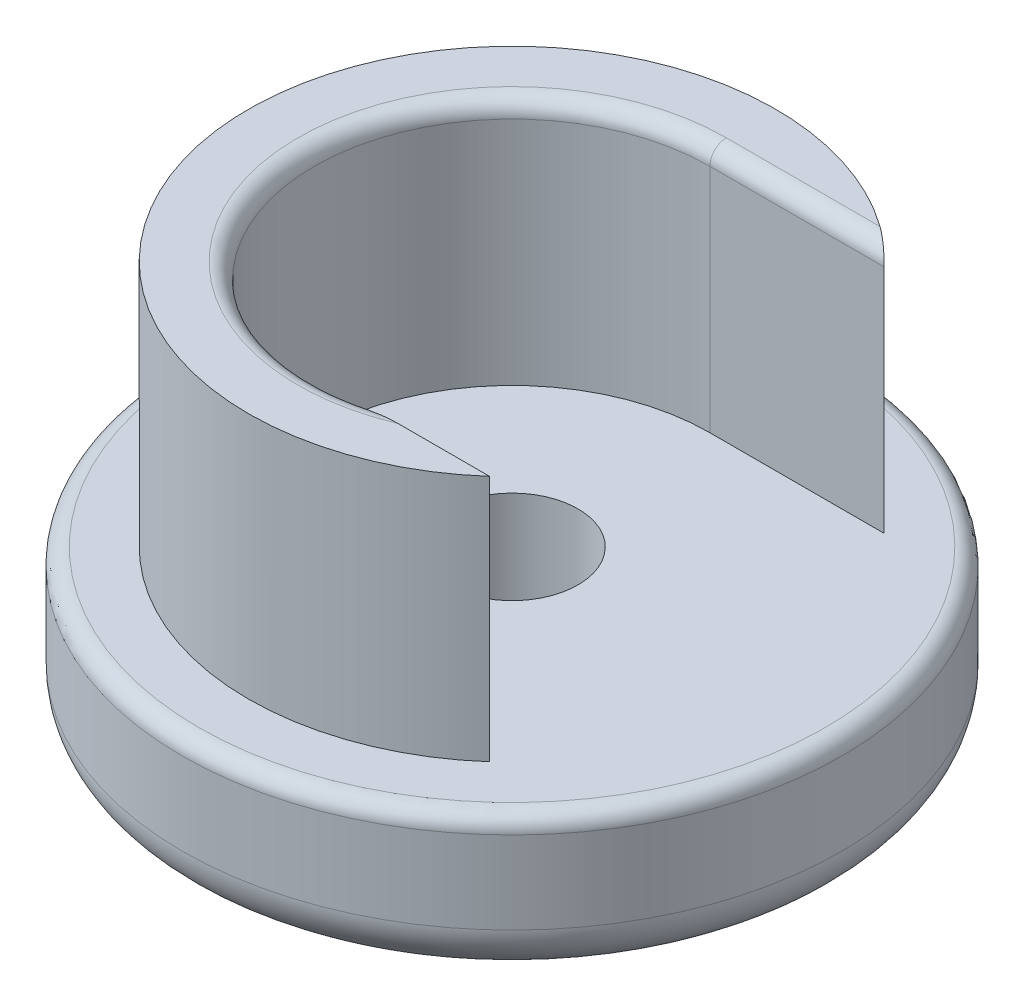
ISO-10303-21;
HEADER;
FILE_DESCRIPTION(('STEP AP214'),'2;1');
FILE_NAME('part.step','',(''),(''),'','','');
FILE_SCHEMA(('AUTOMOTIVE_DESIGN { 1 0 10303 214 1 1 1 1 }'));
ENDSEC;
DATA;
#1=APPLICATION_CONTEXT('core data for automotive mechanical design processes');
#2=APPLICATION_PROTOCOL_DEFINITION('international standard','automotive_design',2000,#1);
#3=PRODUCT_CONTEXT('',#1,'mechanical');
#4=PRODUCT('Part','Part','',(#3));
#5=PRODUCT_RELATED_PRODUCT_CATEGORY('part','',(#4));
#6=PRODUCT_DEFINITION_FORMATION('','',#4);
#7=PRODUCT_DEFINITION_CONTEXT('part definition',#1,'design');
#8=PRODUCT_DEFINITION('design','',#6,#7);
#9=PRODUCT_DEFINITION_SHAPE('','',#8);
#10=(LENGTH_UNIT() NAMED_UNIT(*) SI_UNIT(.MILLI.,.METRE.));
#11=(NAMED_UNIT(*) PLANE_ANGLE_UNIT() SI_UNIT($,.RADIAN.));
#12=(NAMED_UNIT(*) SI_UNIT($,.STERADIAN.) SOLID_ANGLE_UNIT());
#13=UNCERTAINTY_MEASURE_WITH_UNIT(LENGTH_MEASURE(1.E-05),#10,'distance_accuracy_value','');
#14=(GEOMETRIC_REPRESENTATION_CONTEXT(3) GLOBAL_UNCERTAINTY_ASSIGNED_CONTEXT((#13)) GLOBAL_UNIT_ASSIGNED_CONTEXT((#10,
#11,#12)) REPRESENTATION_CONTEXT('',''));
#15=CARTESIAN_POINT('',(0.,0.,0.));
#16=DIRECTION('',(0.,0.,1.));
#17=DIRECTION('',(1.,0.,0.));
#18=AXIS2_PLACEMENT_3D('',#15,#16,#17);
#19=CARTESIAN_POINT('',(0.,9.,0.));
#20=DIRECTION('',(0.,1.,0.));
#21=DIRECTION('',(0.,0.,1.));
#22=AXIS2_PLACEMENT_3D('',#19,#20,#21);
#23=CYLINDRICAL_SURFACE('',#22,12.);
#24=DIRECTION('',(0.,1.,0.));
#25=VECTOR('',#24,1.);
#26=CARTESIAN_POINT('',(0.,9.,-12.));
#27=LINE('',#26,#25);
#28=CARTESIAN_POINT('',(0.,9.,-12.));
#29=VERTEX_POINT('',#28);
#30=CARTESIAN_POINT('',(0.,23.,-12.));
#31=VERTEX_POINT('',#30);
#32=EDGE_CURVE('E123',#29,#31,#27,.T.);
#33=ORIENTED_EDGE('',*,*,#32,.T.);
#34=CARTESIAN_POINT('',(0.,23.,0.));
#35=DIRECTION('',(0.,1.,0.));
#36=DIRECTION('',(0.,0.,1.));
#37=AXIS2_PLACEMENT_3D('',#34,#35,#36);
#38=CIRCLE('',#37,12.);
#39=CARTESIAN_POINT('',(0.749948450219691,23.,11.9765427950646));
#40=VERTEX_POINT('',#39);
#41=EDGE_CURVE('E55',#31,#40,#38,.T.);
#42=ORIENTED_EDGE('',*,*,#41,.T.);
#43=DIRECTION('',(0.,1.,0.));
#44=VECTOR('',#43,1.);
#45=CARTESIAN_POINT('',(0.749948450219691,9.,11.9765427950646));
#46=LINE('',#45,#44);
#47=CARTESIAN_POINT('',(0.749948450219691,9.,11.9765427950646));
#48=VERTEX_POINT('',#47);
#49=EDGE_CURVE('E118',#40,#48,#46,.F.);
#50=ORIENTED_EDGE('',*,*,#49,.T.);
#51=CARTESIAN_POINT('',(0.,9.,0.));
#52=DIRECTION('',(0.,1.,0.));
#53=DIRECTION('',(0.,0.,1.));
#54=AXIS2_PLACEMENT_3D('',#51,#52,#53);
#55=CIRCLE('',#54,12.);
#56=EDGE_CURVE('E111',#29,#48,#55,.T.);
#57=ORIENTED_EDGE('',*,*,#56,.F.);
#58=EDGE_LOOP('',(#33,#42,#50,#57));
#59=FACE_BOUND('',#58,.T.);
#60=ADVANCED_FACE('F39',(#59),#23,.F.);
#61=CARTESIAN_POINT('',(0.,9.,0.));
#62=DIRECTION('',(0.,-1.,0.));
#63=DIRECTION('',(0.,0.,-1.));
#64=AXIS2_PLACEMENT_3D('',#61,#62,#63);
#65=CYLINDRICAL_SURFACE('',#64,20.);
#66=CARTESIAN_POINT('',(0.,8.,0.));
#67=DIRECTION('',(0.,1.,0.));
#68=DIRECTION('',(0.,0.,1.));
#69=AXIS2_PLACEMENT_3D('',#66,#67,#68);
#70=CIRCLE('',#69,20.);
#71=CARTESIAN_POINT('',(0.,8.,20.));
#72=VERTEX_POINT('',#71);
#73=EDGE_CURVE('E11',#72,#72,#70,.F.);
#74=ORIENTED_EDGE('',*,*,#73,.T.);
#75=EDGE_LOOP('',(#74));
#76=FACE_BOUND('',#75,.T.);
#77=CARTESIAN_POINT('',(0.,3.,0.));
#78=DIRECTION('',(0.,1.,0.));
#79=DIRECTION('',(0.,0.,1.));
#80=AXIS2_PLACEMENT_3D('',#77,#78,#79);
#81=CIRCLE('',#80,20.);
#82=CARTESIAN_POINT('',(0.,3.,20.));
#83=VERTEX_POINT('',#82);
#84=EDGE_CURVE('E176',#83,#83,#81,.T.);
#85=ORIENTED_EDGE('',*,*,#84,.T.);
#86=EDGE_LOOP('',(#85));
#87=FACE_BOUND('',#86,.T.);
#88=ADVANCED_FACE('F163',(#76,#87),#65,.T.);
#89=CARTESIAN_POINT('',(0.,9.,0.));
#90=DIRECTION('',(0.,1.,0.));
#91=DIRECTION('',(0.,0.,1.));
#92=AXIS2_PLACEMENT_3D('',#89,#90,#91);
#93=PLANE('',#92);
#94=CARTESIAN_POINT('',(0.,9.,0.));
#95=DIRECTION('',(0.,1.,0.));
#96=DIRECTION('',(0.,0.,1.));
#97=AXIS2_PLACEMENT_3D('',#94,#95,#96);
#98=CIRCLE('',#97,19.);
#99=CARTESIAN_POINT('',(0.,9.,19.));
#100=VERTEX_POINT('',#99);
#101=EDGE_CURVE('E48',#100,#100,#98,.T.);
#102=ORIENTED_EDGE('',*,*,#101,.T.);
#103=EDGE_LOOP('',(#102));
#104=FACE_BOUND('',#103,.T.);
#105=CARTESIAN_POINT('',(0.,9.,0.));
#106=DIRECTION('',(0.,1.,0.));
#107=DIRECTION('',(0.,0.,1.));
#108=AXIS2_PLACEMENT_3D('',#105,#106,#107);
#109=CIRCLE('',#108,4.);
#110=CARTESIAN_POINT('',(0.,9.,4.));
#111=VERTEX_POINT('',#110);
#112=EDGE_CURVE('E235',#111,#111,#109,.T.);
#113=ORIENTED_EDGE('',*,*,#112,.F.);
#114=EDGE_LOOP('',(#113));
#115=FACE_BOUND('',#114,.T.);
#116=CARTESIAN_POINT('',(0.,9.,0.));
#117=DIRECTION('',(0.,1.,0.));
#118=DIRECTION('',(0.,0.,1.));
#119=AXIS2_PLACEMENT_3D('',#116,#117,#118);
#120=CIRCLE('',#119,16.);
#121=CARTESIAN_POINT('',(10.5830052442584,9.,-12.));
#122=VERTEX_POINT('',#121);
#123=CARTESIAN_POINT('',(10.6095439429783,9.,11.9765427950646));
#124=VERTEX_POINT('',#123);
#125=EDGE_CURVE('E110',#122,#124,#120,.T.);
#126=ORIENTED_EDGE('',*,*,#125,.F.);
#127=DIRECTION('',(-1.,0.,0.));
#128=VECTOR('',#127,1.);
#129=CARTESIAN_POINT('',(0.,9.,-12.));
#130=LINE('',#129,#128);
#131=EDGE_CURVE('E227',#122,#29,#130,.T.);
#132=ORIENTED_EDGE('',*,*,#131,.T.);
#133=ORIENTED_EDGE('',*,*,#56,.T.);
#134=DIRECTION('',(1.,0.,0.));
#135=VECTOR('',#134,1.);
#136=CARTESIAN_POINT('',(0.,9.,11.9765427950646));
#137=LINE('',#136,#135);
#138=EDGE_CURVE('E100',#48,#124,#137,.T.);
#139=ORIENTED_EDGE('',*,*,#138,.T.);
#140=EDGE_LOOP('',(#126,#132,#133,#139));
#141=FACE_BOUND('',#140,.T.);
#142=ADVANCED_FACE('F161',(#104,#115,#141),#93,.T.);
#143=CARTESIAN_POINT('',(0.,0.,0.));
#144=DIRECTION('',(0.,1.,0.));
#145=DIRECTION('',(0.,0.,1.));
#146=AXIS2_PLACEMENT_3D('',#143,#144,#145);
#147=PLANE('',#146);
#148=CARTESIAN_POINT('',(0.,0.,0.));
#149=DIRECTION('',(0.,1.,0.));
#150=DIRECTION('',(0.,0.,1.));
#151=AXIS2_PLACEMENT_3D('',#148,#149,#150);
#152=CIRCLE('',#151,17.);
#153=CARTESIAN_POINT('',(0.,0.,17.));
#154=VERTEX_POINT('',#153);
#155=EDGE_CURVE('E179',#154,#154,#152,.F.);
#156=ORIENTED_EDGE('',*,*,#155,.T.);
#157=EDGE_LOOP('',(#156));
#158=FACE_BOUND('',#157,.T.);
#159=CARTESIAN_POINT('',(0.,0.,0.));
#160=DIRECTION('',(0.,1.,0.));
#161=DIRECTION('',(0.,0.,1.));
#162=AXIS2_PLACEMENT_3D('',#159,#160,#161);
#163=CIRCLE('',#162,4.);
#164=CARTESIAN_POINT('',(0.,0.,4.));
#165=VERTEX_POINT('',#164);
#166=EDGE_CURVE('E231',#165,#165,#163,.T.);
#167=ORIENTED_EDGE('',*,*,#166,.T.);
#168=EDGE_LOOP('',(#167));
#169=FACE_BOUND('',#168,.T.);
#170=ADVANCED_FACE('F158',(#158,#169),#147,.F.);
#171=CARTESIAN_POINT('',(0.,24.,0.));
#172=DIRECTION('',(0.,-1.,0.));
#173=DIRECTION('',(0.,0.,-1.));
#174=AXIS2_PLACEMENT_3D('',#171,#172,#173);
#175=CYLINDRICAL_SURFACE('',#174,16.);
#176=CARTESIAN_POINT('',(0.,24.,0.));
#177=DIRECTION('',(0.,1.,0.));
#178=DIRECTION('',(0.,0.,1.));
#179=AXIS2_PLACEMENT_3D('',#176,#177,#178);
#180=CIRCLE('',#179,16.);
#181=CARTESIAN_POINT('',(9.32737905308881,24.,-13.));
#182=VERTEX_POINT('',#181);
#183=CARTESIAN_POINT('',(10.6095439429783,24.,11.9765427950646));
#184=VERTEX_POINT('',#183);
#185=EDGE_CURVE('E104',#182,#184,#180,.T.);
#186=ORIENTED_EDGE('',*,*,#185,.F.);
#187=CARTESIAN_POINT('',(9.32737905308881,24.,-13.));
#188=CARTESIAN_POINT('',(9.38733669960589,23.9999699236779,-12.9569877648365));
#189=CARTESIAN_POINT('',(9.44702896333437,23.9972209178862,-12.9135242128153));
#190=CARTESIAN_POINT('',(9.56569114898083,23.9857277500073,-12.8258711496793));
#191=CARTESIAN_POINT('',(9.62465675188453,23.976957333956,-12.7816792899183));
#192=CARTESIAN_POINT('',(9.74198014743399,23.9526809597153,-12.6924914834544));
#193=CARTESIAN_POINT('',(9.80031689759493,23.9370796516231,-12.6474931343324));
#194=CARTESIAN_POINT('',(9.91470628052456,23.8983466310327,-12.5580193809069));
#195=CARTESIAN_POINT('',(9.9707633580954,23.8752304493649,-12.5135430924278));
#196=CARTESIAN_POINT('',(10.0743631479326,23.8231389253245,-12.43025272751));
#197=CARTESIAN_POINT('',(10.1222010874204,23.7949631627753,-12.3913119007309));
#198=CARTESIAN_POINT('',(10.2141102835149,23.7308406547604,-12.3156595837218));
#199=CARTESIAN_POINT('',(10.258193013547,23.6949188580304,-12.2789414099318));
#200=CARTESIAN_POINT('',(10.3343339357437,23.6209610992055,-12.2148926981825));
#201=CARTESIAN_POINT('',(10.3671801231821,23.584228667156,-12.187008387329));
#202=CARTESIAN_POINT('',(10.4278169529509,23.5043007912501,-12.1351645545671));
#203=CARTESIAN_POINT('',(10.4556133722305,23.4611128369971,-12.1112005509805));
#204=CARTESIAN_POINT('',(10.4982096913637,23.3801206892692,-12.0742777351078));
#205=CARTESIAN_POINT('',(10.5145204783598,23.3436866857635,-12.0600664156176));
#206=CARTESIAN_POINT('',(10.5423931939421,23.2678100690204,-12.0357088719517));
#207=CARTESIAN_POINT('',(10.5539663186246,23.2283748132538,-12.0255530651535));
#208=CARTESIAN_POINT('',(10.5693991718057,23.1574562591511,-12.0119891523348));
#209=CARTESIAN_POINT('',(10.5744609850242,23.1264319504551,-12.0075314106389));
#210=CARTESIAN_POINT('',(10.5812829467142,23.0636196167996,-12.0015189364844));
#211=CARTESIAN_POINT('',(10.5830294262096,23.0318289749586,-11.9999762226784));
#212=CARTESIAN_POINT('',(10.5830052442584,23.,-12.));
#213=B_SPLINE_CURVE_WITH_KNOTS('',3,(#187,#188,#189,#190,#191,#192,#193,#194,#195,#196,#197,
#198,#199,#200,#201,#202,#203,#204,#205,#206,#207,#208,#209,#210,#211,#212),.UNSPECIFIED.,.F.,
.F.,(4,2,2,2,2,2,2,2,2,2,2,2,4),(0.,0.221390816364776,0.443753101156386,0.669323464806758,
0.894430579430143,1.09740414310825,1.29973347417375,1.46901710335517,1.63810583501812,
1.76474676296203,1.8910866595096,1.98603287848848,2.08136971348778),.UNSPECIFIED.);
#214=CARTESIAN_POINT('',(10.5830052442584,23.,-12.));
#215=VERTEX_POINT('',#214);
#216=EDGE_CURVE('E140',#182,#215,#213,.T.);
#217=ORIENTED_EDGE('',*,*,#216,.T.);
#218=DIRECTION('',(0.,-1.,0.));
#219=VECTOR('',#218,1.);
#220=CARTESIAN_POINT('',(10.5830052442584,24.,-12.));
#221=LINE('',#220,#219);
#222=EDGE_CURVE('E117',#215,#122,#221,.T.);
#223=ORIENTED_EDGE('',*,*,#222,.T.);
#224=ORIENTED_EDGE('',*,*,#125,.T.);
#225=DIRECTION('',(0.,-1.,0.));
#226=VECTOR('',#225,1.);
#227=CARTESIAN_POINT('',(10.6095439429783,24.,11.9765427950646));
#228=LINE('',#227,#226);
#229=EDGE_CURVE('E95',#124,#184,#228,.F.);
#230=ORIENTED_EDGE('',*,*,#229,.T.);
#231=EDGE_LOOP('',(#186,#217,#223,#224,#230));
#232=FACE_BOUND('',#231,.T.);
#233=ADVANCED_FACE('F114',(#232),#175,.T.);
#234=CARTESIAN_POINT('',(0.,24.,0.));
#235=DIRECTION('',(0.,1.,0.));
#236=DIRECTION('',(0.,0.,1.));
#237=AXIS2_PLACEMENT_3D('',#234,#235,#236);
#238=PLANE('',#237);
#239=CARTESIAN_POINT('',(0.,24.,0.));
#240=DIRECTION('',(0.,1.,0.));
#241=DIRECTION('',(0.,0.,1.));
#242=AXIS2_PLACEMENT_3D('',#239,#240,#241);
#243=CIRCLE('',#242,13.);
#244=CARTESIAN_POINT('',(5.05592945737843,24.,11.9765427950646));
#245=VERTEX_POINT('',#244);
#246=CARTESIAN_POINT('',(0.,24.,-13.));
#247=VERTEX_POINT('',#246);
#248=EDGE_CURVE('E63',#245,#247,#243,.F.);
#249=ORIENTED_EDGE('',*,*,#248,.T.);
#250=DIRECTION('',(-1.,0.,0.));
#251=VECTOR('',#250,1.);
#252=CARTESIAN_POINT('',(10.5830052442584,24.,-13.));
#253=LINE('',#252,#251);
#254=EDGE_CURVE('E106',#247,#182,#253,.F.);
#255=ORIENTED_EDGE('',*,*,#254,.T.);
#256=ORIENTED_EDGE('',*,*,#185,.T.);
#257=DIRECTION('',(1.,0.,0.));
#258=VECTOR('',#257,1.);
#259=CARTESIAN_POINT('',(0.,24.,11.9765427950646));
#260=LINE('',#259,#258);
#261=EDGE_CURVE('E90',#245,#184,#260,.T.);
#262=ORIENTED_EDGE('',*,*,#261,.F.);
#263=EDGE_LOOP('',(#249,#255,#256,#262));
#264=FACE_BOUND('',#263,.T.);
#265=ADVANCED_FACE('F105',(#264),#238,.T.);
#266=CARTESIAN_POINT('',(0.,9.,-12.));
#267=DIRECTION('',(0.,0.,-1.));
#268=DIRECTION('',(-1.,0.,0.));
#269=AXIS2_PLACEMENT_3D('',#266,#267,#268);
#270=PLANE('',#269);
#271=ORIENTED_EDGE('',*,*,#222,.F.);
#272=DIRECTION('',(-1.,0.,0.));
#273=VECTOR('',#272,1.);
#274=CARTESIAN_POINT('',(0.,23.,-12.));
#275=LINE('',#274,#273);
#276=EDGE_CURVE('E132',#215,#31,#275,.T.);
#277=ORIENTED_EDGE('',*,*,#276,.T.);
#278=ORIENTED_EDGE('',*,*,#32,.F.);
#279=ORIENTED_EDGE('',*,*,#131,.F.);
#280=EDGE_LOOP('',(#271,#277,#278,#279));
#281=FACE_BOUND('',#280,.T.);
#282=ADVANCED_FACE('F217',(#281),#270,.F.);
#283=CARTESIAN_POINT('',(0.,9.,11.9765427950646));
#284=DIRECTION('',(0.,0.,1.));
#285=DIRECTION('',(1.,0.,0.));
#286=AXIS2_PLACEMENT_3D('',#283,#284,#285);
#287=PLANE('',#286);
#288=ORIENTED_EDGE('',*,*,#49,.F.);
#289=CARTESIAN_POINT('',(0.749948450219691,23.,11.9765427950646));
#290=CARTESIAN_POINT('',(0.749935232469696,23.0039757207967,11.9765427950646));
#291=CARTESIAN_POINT('',(0.750327266910166,23.0079322704996,11.9765427950646));
#292=CARTESIAN_POINT('',(0.751793892167884,23.0156566089796,11.9765427950646));
#293=CARTESIAN_POINT('',(0.752857895365614,23.0194263647267,11.9765427950646));
#294=CARTESIAN_POINT('',(0.756010863660049,23.0280173697372,11.9765427950646));
#295=CARTESIAN_POINT('',(0.758326705800493,23.0327531775025,11.9765427950646));
#296=CARTESIAN_POINT('',(0.763668811319105,23.0418314973793,11.9765427950646));
#297=CARTESIAN_POINT('',(0.766699983942616,23.046170990593,11.9765427950646));
#298=CARTESIAN_POINT('',(0.777832226229041,23.0603661481454,11.9765427950646));
#299=CARTESIAN_POINT('',(0.787036159397925,23.0693347910738,11.9765427950646));
#300=CARTESIAN_POINT('',(0.806554064313658,23.0859512232397,11.9765427950646));
#301=CARTESIAN_POINT('',(0.816874409307471,23.0935907010513,11.9765427950646));
#302=CARTESIAN_POINT('',(0.848982795973364,23.1154610788035,11.9765427950646));
#303=CARTESIAN_POINT('',(0.87164839241315,23.1283901382313,11.9765427950646));
#304=CARTESIAN_POINT('',(0.917853022371373,23.1526063005538,11.9765427950646));
#305=CARTESIAN_POINT('',(0.941394530609221,23.1638882246322,11.9765427950646));
#306=CARTESIAN_POINT('',(0.988998280382711,23.1854488943696,11.9765427950646));
#307=CARTESIAN_POINT('',(1.0130615235952,23.1957254537725,11.9765427950646));
#308=CARTESIAN_POINT('',(1.06142555668921,23.215578180964,11.9765427950646));
#309=CARTESIAN_POINT('',(1.08572592399549,23.2251554023076,11.9765427950646));
#310=CARTESIAN_POINT('',(1.15838852180002,23.2529660652195,11.9765427950646));
#311=CARTESIAN_POINT('',(1.20701969207295,23.2704959656999,11.9765427950646));
#312=CARTESIAN_POINT('',(1.3046792165186,23.3044177142769,11.9765427950646));
#313=CARTESIAN_POINT('',(1.35370764214515,23.3208093523227,11.9765427950646));
#314=CARTESIAN_POINT('',(1.50127543593803,23.3688205200122,11.9765427950646));
#315=CARTESIAN_POINT('',(1.60020410314436,23.399242598267,11.9765427950646));
#316=CARTESIAN_POINT('',(1.79833073051,23.4578943757002,11.9765427950646));
#317=CARTESIAN_POINT('',(1.89752659839255,23.486131246689,11.9765427950646));
#318=CARTESIAN_POINT('',(2.09638386005526,23.5407888128811,11.9765427950646));
#319=CARTESIAN_POINT('',(2.19604510275871,23.5672100589249,11.9765427950646));
#320=CARTESIAN_POINT('',(2.52122118355102,23.6504052018259,11.9765427950646));
#321=CARTESIAN_POINT('',(2.74765321569406,23.7036401576265,11.9765427950646));
#322=CARTESIAN_POINT('',(3.2026852293018,23.7998591801766,11.9765427950646));
#323=CARTESIAN_POINT('',(3.43128477841245,23.8428452483311,11.9765427950646));
#324=CARTESIAN_POINT('',(3.77620353757162,23.8974732532332,11.9765427950646));
#325=CARTESIAN_POINT('',(3.89174136405927,23.9140635136442,11.9765427950646));
#326=CARTESIAN_POINT('',(4.12329220059164,23.9433959708142,11.9765427950646));
#327=CARTESIAN_POINT('',(4.23930513316165,23.9561387714831,11.9765427950646));
#328=CARTESIAN_POINT('',(4.47192159480133,23.9772025165152,11.9765427950646));
#329=CARTESIAN_POINT('',(4.58852575105408,23.9855167566126,11.9765427950646));
#330=CARTESIAN_POINT('',(4.82204908217143,23.9968985689777,11.9765427950646));
#331=CARTESIAN_POINT('',(4.93896839640681,23.9999632139505,11.9765427950646));
#332=CARTESIAN_POINT('',(5.05592945737842,24.,11.9765427950646));
#333=B_SPLINE_CURVE_WITH_KNOTS('',3,(#289,#290,#291,#292,#293,#294,#295,#296,#297,#298,#299,
#300,#301,#302,#303,#304,#305,#306,#307,#308,#309,#310,#311,#312,#313,#314,#315,#316,#317,#318,
#319,#320,#321,#322,#323,#324,#325,#326,#327,#328,#329,#330,#331,#332),.UNSPECIFIED.,.F.,.F.,(4,
2,2,2,2,2,2,2,2,2,2,2,2,2,2,2,2,2,2,2,2,4),(0.,0.0118770803321293,0.0235715395773735,
0.0392968985597627,0.055133489766552,0.093387661029101,0.131873055550755,0.209940614889276,
0.288248574238231,0.3667232029754,0.445077060110991,0.600129866904549,0.755211210964169,
1.06567111107627,1.37506458998385,1.68436378409099,2.38198301020709,3.0794658932953,
3.42958181432669,3.77964275140272,4.13023213984363,4.48101696143569),.UNSPECIFIED.);
#334=EDGE_CURVE('E98',#40,#245,#333,.T.);
#335=ORIENTED_EDGE('',*,*,#334,.T.);
#336=ORIENTED_EDGE('',*,*,#261,.T.);
#337=ORIENTED_EDGE('',*,*,#229,.F.);
#338=ORIENTED_EDGE('',*,*,#138,.F.);
#339=EDGE_LOOP('',(#288,#335,#336,#337,#338));
#340=FACE_BOUND('',#339,.T.);
#341=ADVANCED_FACE('F92',(#340),#287,.F.);
#342=CARTESIAN_POINT('',(0.,23.,0.));
#343=DIRECTION('',(0.,1.,0.));
#344=DIRECTION('',(0.,0.,1.));
#345=AXIS2_PLACEMENT_3D('',#342,#343,#344);
#346=TOROIDAL_SURFACE('',#345,13.,1.);
#347=ORIENTED_EDGE('',*,*,#334,.F.);
#348=ORIENTED_EDGE('',*,*,#41,.F.);
#349=CARTESIAN_POINT('',(0.,23.,-13.));
#350=DIRECTION('',(1.,0.,0.));
#351=DIRECTION('',(0.,0.,-1.));
#352=AXIS2_PLACEMENT_3D('',#349,#350,#351);
#353=CIRCLE('',#352,1.);
#354=EDGE_CURVE('E101',#247,#31,#353,.T.);
#355=ORIENTED_EDGE('',*,*,#354,.F.);
#356=ORIENTED_EDGE('',*,*,#248,.F.);
#357=EDGE_LOOP('',(#347,#348,#355,#356));
#358=FACE_BOUND('',#357,.T.);
#359=ADVANCED_FACE('F205',(#358),#346,.T.);
#360=CARTESIAN_POINT('',(0.,23.,-13.));
#361=DIRECTION('',(1.,0.,0.));
#362=DIRECTION('',(0.,0.,-1.));
#363=AXIS2_PLACEMENT_3D('',#360,#361,#362);
#364=CYLINDRICAL_SURFACE('',#363,1.);
#365=ORIENTED_EDGE('',*,*,#216,.F.);
#366=ORIENTED_EDGE('',*,*,#254,.F.);
#367=ORIENTED_EDGE('',*,*,#354,.T.);
#368=ORIENTED_EDGE('',*,*,#276,.F.);
#369=EDGE_LOOP('',(#365,#366,#367,#368));
#370=FACE_BOUND('',#369,.T.);
#371=ADVANCED_FACE('F150',(#370),#364,.T.);
#372=CARTESIAN_POINT('',(0.,0.,0.));
#373=DIRECTION('',(0.,1.,0.));
#374=DIRECTION('',(0.,0.,1.));
#375=AXIS2_PLACEMENT_3D('',#372,#373,#374);
#376=CYLINDRICAL_SURFACE('',#375,4.);
#377=ORIENTED_EDGE('',*,*,#166,.F.);
#378=EDGE_LOOP('',(#377));
#379=FACE_BOUND('',#378,.T.);
#380=ORIENTED_EDGE('',*,*,#112,.T.);
#381=EDGE_LOOP('',(#380));
#382=FACE_BOUND('',#381,.T.);
#383=ADVANCED_FACE('F197',(#379,#382),#376,.F.);
#384=CARTESIAN_POINT('',(0.,3.,0.));
#385=DIRECTION('',(0.,1.,0.));
#386=DIRECTION('',(0.,0.,1.));
#387=AXIS2_PLACEMENT_3D('',#384,#385,#386);
#388=TOROIDAL_SURFACE('',#387,17.,3.);
#389=ORIENTED_EDGE('',*,*,#155,.F.);
#390=EDGE_LOOP('',(#389));
#391=FACE_BOUND('',#390,.T.);
#392=ORIENTED_EDGE('',*,*,#84,.F.);
#393=EDGE_LOOP('',(#392));
#394=FACE_BOUND('',#393,.T.);
#395=ADVANCED_FACE('F192',(#391,#394),#388,.T.);
#396=CARTESIAN_POINT('',(0.,8.,0.));
#397=DIRECTION('',(0.,1.,0.));
#398=DIRECTION('',(0.,0.,1.));
#399=AXIS2_PLACEMENT_3D('',#396,#397,#398);
#400=TOROIDAL_SURFACE('',#399,19.,1.);
#401=ORIENTED_EDGE('',*,*,#73,.F.);
#402=EDGE_LOOP('',(#401));
#403=FACE_BOUND('',#402,.T.);
#404=ORIENTED_EDGE('',*,*,#101,.F.);
#405=EDGE_LOOP('',(#404));
#406=FACE_BOUND('',#405,.T.);
#407=ADVANCED_FACE('F41',(#403,#406),#400,.T.);
#408=CLOSED_SHELL('',(#60,#88,#142,#170,#233,#265,#282,#341,#359,#371,#383,#395,#407));
#409=MANIFOLD_SOLID_BREP('B2',#408);
#410=ADVANCED_BREP_SHAPE_REPRESENTATION('',(#18,#409),#14);
#411=SHAPE_DEFINITION_REPRESENTATION(#9,#410);
ENDSEC;
END-ISO-10303-21;
